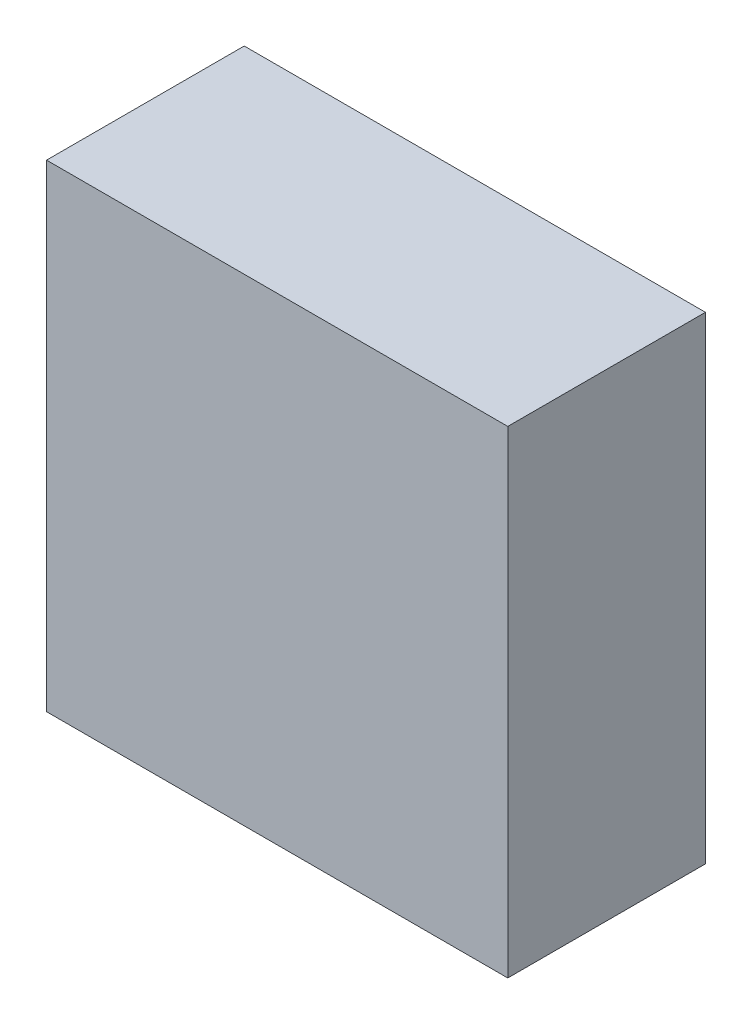
ISO-10303-21;
HEADER;
FILE_DESCRIPTION(('STEP AP214'),'2;1');
FILE_NAME('part.step','',(''),(''),'','','');
FILE_SCHEMA(('AUTOMOTIVE_DESIGN { 1 0 10303 214 1 1 1 1 }'));
ENDSEC;
DATA;
#1=APPLICATION_CONTEXT('core data for automotive mechanical design processes');
#2=APPLICATION_PROTOCOL_DEFINITION('international standard','automotive_design',2000,#1);
#3=PRODUCT_CONTEXT('',#1,'mechanical');
#4=PRODUCT('Part','Part','',(#3));
#5=PRODUCT_RELATED_PRODUCT_CATEGORY('part','',(#4));
#6=PRODUCT_DEFINITION_FORMATION('','',#4);
#7=PRODUCT_DEFINITION_CONTEXT('part definition',#1,'design');
#8=PRODUCT_DEFINITION('design','',#6,#7);
#9=PRODUCT_DEFINITION_SHAPE('','',#8);
#10=(LENGTH_UNIT() NAMED_UNIT(*) SI_UNIT(.MILLI.,.METRE.));
#11=(NAMED_UNIT(*) PLANE_ANGLE_UNIT() SI_UNIT($,.RADIAN.));
#12=(NAMED_UNIT(*) SI_UNIT($,.STERADIAN.) SOLID_ANGLE_UNIT());
#13=UNCERTAINTY_MEASURE_WITH_UNIT(LENGTH_MEASURE(1.E-05),#10,'distance_accuracy_value','');
#14=(GEOMETRIC_REPRESENTATION_CONTEXT(3) GLOBAL_UNCERTAINTY_ASSIGNED_CONTEXT((#13)) GLOBAL_UNIT_ASSIGNED_CONTEXT((#10,
#11,#12)) REPRESENTATION_CONTEXT('',''));
#15=CARTESIAN_POINT('',(0.,0.,0.));
#16=DIRECTION('',(0.,0.,1.));
#17=DIRECTION('',(1.,0.,0.));
#18=AXIS2_PLACEMENT_3D('',#15,#16,#17);
#19=CARTESIAN_POINT('',(-0.700001716857926,0.724992278693463,0.));
#20=DIRECTION('',(-1.,1.19248806385031E-08,0.));
#21=DIRECTION('',(-1.19248806385031E-08,-1.,0.));
#22=AXIS2_PLACEMENT_3D('',#19,#20,#21);
#23=PLANE('',#22);
#24=DIRECTION('',(-1.1924880607005E-08,-1.,0.));
#25=VECTOR('',#24,1.);
#26=CARTESIAN_POINT('',(-0.700001716857926,0.724992278693463,0.));
#27=LINE('',#26,#25);
#28=CARTESIAN_POINT('',(-0.700001716857926,0.724992278693463,0.));
#29=VERTEX_POINT('',#28);
#30=CARTESIAN_POINT('',(-0.700001734148969,-0.725004669548724,0.));
#31=VERTEX_POINT('',#30);
#32=EDGE_CURVE('E11',#29,#31,#27,.T.);
#33=ORIENTED_EDGE('',*,*,#32,.T.);
#34=DIRECTION('',(0.,0.,1.));
#35=VECTOR('',#34,1.);
#36=CARTESIAN_POINT('',(-0.700001734148967,-0.725004669548724,0.));
#37=LINE('',#36,#35);
#38=CARTESIAN_POINT('',(-0.700001734148969,-0.725004669548724,0.599998772144318));
#39=VERTEX_POINT('',#38);
#40=EDGE_CURVE('E88',#31,#39,#37,.T.);
#41=ORIENTED_EDGE('',*,*,#40,.T.);
#42=DIRECTION('',(-1.1924880607005E-08,-1.,0.));
#43=VECTOR('',#42,1.);
#44=CARTESIAN_POINT('',(-0.700001716857926,0.724992278693463,0.599998772144318));
#45=LINE('',#44,#43);
#46=CARTESIAN_POINT('',(-0.700001716857926,0.724992278693463,0.599998772144318));
#47=VERTEX_POINT('',#46);
#48=EDGE_CURVE('E83',#47,#39,#45,.T.);
#49=ORIENTED_EDGE('',*,*,#48,.F.);
#50=DIRECTION('',(0.,0.,1.));
#51=VECTOR('',#50,1.);
#52=CARTESIAN_POINT('',(-0.700001716857926,0.724992278693453,0.));
#53=LINE('',#52,#51);
#54=EDGE_CURVE('E72',#29,#47,#53,.T.);
#55=ORIENTED_EDGE('',*,*,#54,.F.);
#56=EDGE_LOOP('',(#33,#41,#49,#55));
#57=FACE_BOUND('',#56,.T.);
#58=ADVANCED_FACE('F17',(#57),#23,.T.);
#59=CARTESIAN_POINT('',(-0.700001734148969,-0.725004669548724,0.));
#60=DIRECTION('',(-1.19248806385031E-08,-1.,0.));
#61=DIRECTION('',(1.,-1.19248806385031E-08,0.));
#62=AXIS2_PLACEMENT_3D('',#59,#60,#61);
#63=PLANE('',#62);
#64=DIRECTION('',(1.,-1.1924880652559E-08,0.));
#65=VECTOR('',#64,1.);
#66=CARTESIAN_POINT('',(-0.700001734148969,-0.725004669548724,0.));
#67=LINE('',#66,#65);
#68=CARTESIAN_POINT('',(0.699992162335406,-0.725004686243494,0.));
#69=VERTEX_POINT('',#68);
#70=EDGE_CURVE('E24',#31,#69,#67,.T.);
#71=ORIENTED_EDGE('',*,*,#70,.T.);
#72=DIRECTION('',(0.,0.,1.));
#73=VECTOR('',#72,1.);
#74=CARTESIAN_POINT('',(0.699992162335406,-0.725004686243484,0.));
#75=LINE('',#74,#73);
#76=CARTESIAN_POINT('',(0.699992162335406,-0.725004686243494,0.599998772144318));
#77=VERTEX_POINT('',#76);
#78=EDGE_CURVE('E85',#69,#77,#75,.T.);
#79=ORIENTED_EDGE('',*,*,#78,.T.);
#80=DIRECTION('',(1.,-1.1924880652559E-08,0.));
#81=VECTOR('',#80,1.);
#82=CARTESIAN_POINT('',(-0.700001734148969,-0.725004669548724,0.599998772144318));
#83=LINE('',#82,#81);
#84=EDGE_CURVE('E66',#39,#77,#83,.T.);
#85=ORIENTED_EDGE('',*,*,#84,.F.);
#86=ORIENTED_EDGE('',*,*,#40,.F.);
#87=EDGE_LOOP('',(#71,#79,#85,#86));
#88=FACE_BOUND('',#87,.T.);
#89=ADVANCED_FACE('F89',(#88),#63,.T.);
#90=CARTESIAN_POINT('',(0.699992162335406,-0.725004686243494,0.));
#91=DIRECTION('',(1.,-1.19248806385031E-08,0.));
#92=DIRECTION('',(1.19248806385031E-08,1.,0.));
#93=AXIS2_PLACEMENT_3D('',#90,#91,#92);
#94=PLANE('',#93);
#95=DIRECTION('',(1.1924880607005E-08,1.,0.));
#96=VECTOR('',#95,1.);
#97=CARTESIAN_POINT('',(0.699992162335406,-0.725004686243494,0.));
#98=LINE('',#97,#96);
#99=CARTESIAN_POINT('',(0.699992179626449,0.724992261998693,0.));
#100=VERTEX_POINT('',#99);
#101=EDGE_CURVE('E62',#69,#100,#98,.T.);
#102=ORIENTED_EDGE('',*,*,#101,.T.);
#103=DIRECTION('',(0.,0.,1.));
#104=VECTOR('',#103,1.);
#105=CARTESIAN_POINT('',(0.699992179626446,0.724992261998693,0.));
#106=LINE('',#105,#104);
#107=CARTESIAN_POINT('',(0.699992179626449,0.724992261998693,0.599998772144318));
#108=VERTEX_POINT('',#107);
#109=EDGE_CURVE('E55',#100,#108,#106,.T.);
#110=ORIENTED_EDGE('',*,*,#109,.T.);
#111=DIRECTION('',(1.1924880607005E-08,1.,0.));
#112=VECTOR('',#111,1.);
#113=CARTESIAN_POINT('',(0.699992162335406,-0.725004686243494,0.599998772144318));
#114=LINE('',#113,#112);
#115=EDGE_CURVE('E59',#77,#108,#114,.T.);
#116=ORIENTED_EDGE('',*,*,#115,.F.);
#117=ORIENTED_EDGE('',*,*,#78,.F.);
#118=EDGE_LOOP('',(#102,#110,#116,#117));
#119=FACE_BOUND('',#118,.T.);
#120=ADVANCED_FACE('F57',(#119),#94,.T.);
#121=CARTESIAN_POINT('',(0.699992179626449,0.724992261998693,0.));
#122=DIRECTION('',(1.19248806385031E-08,1.,0.));
#123=DIRECTION('',(-1.,1.19248806385031E-08,0.));
#124=AXIS2_PLACEMENT_3D('',#121,#122,#123);
#125=PLANE('',#124);
#126=DIRECTION('',(-1.,1.1924880652559E-08,0.));
#127=VECTOR('',#126,1.);
#128=CARTESIAN_POINT('',(0.699992179626449,0.724992261998693,0.));
#129=LINE('',#128,#127);
#130=EDGE_CURVE('E65',#100,#29,#129,.T.);
#131=ORIENTED_EDGE('',*,*,#130,.T.);
#132=ORIENTED_EDGE('',*,*,#54,.T.);
#133=DIRECTION('',(-1.,1.1924880652559E-08,0.));
#134=VECTOR('',#133,1.);
#135=CARTESIAN_POINT('',(0.699992179626449,0.724992261998693,0.599998772144318));
#136=LINE('',#135,#134);
#137=EDGE_CURVE('E70',#108,#47,#136,.T.);
#138=ORIENTED_EDGE('',*,*,#137,.F.);
#139=ORIENTED_EDGE('',*,*,#109,.F.);
#140=EDGE_LOOP('',(#131,#132,#138,#139));
#141=FACE_BOUND('',#140,.T.);
#142=ADVANCED_FACE('F71',(#141),#125,.T.);
#143=CARTESIAN_POINT('',(119.549995422363,-239.175003051758,0.599998772144318));
#144=DIRECTION('',(0.,0.,1.));
#145=DIRECTION('',(1.19248806385031E-08,1.,0.));
#146=AXIS2_PLACEMENT_3D('',#143,#144,#145);
#147=PLANE('',#146);
#148=ORIENTED_EDGE('',*,*,#48,.T.);
#149=ORIENTED_EDGE('',*,*,#84,.T.);
#150=ORIENTED_EDGE('',*,*,#115,.T.);
#151=ORIENTED_EDGE('',*,*,#137,.T.);
#152=EDGE_LOOP('',(#148,#149,#150,#151));
#153=FACE_BOUND('',#152,.T.);
#154=ADVANCED_FACE('F76',(#153),#147,.T.);
#155=CARTESIAN_POINT('',(119.549995422363,-239.175003051758,0.));
#156=DIRECTION('',(0.,0.,1.));
#157=DIRECTION('',(1.19248806385031E-08,1.,0.));
#158=AXIS2_PLACEMENT_3D('',#155,#156,#157);
#159=PLANE('',#158);
#160=ORIENTED_EDGE('',*,*,#130,.F.);
#161=ORIENTED_EDGE('',*,*,#101,.F.);
#162=ORIENTED_EDGE('',*,*,#70,.F.);
#163=ORIENTED_EDGE('',*,*,#32,.F.);
#164=EDGE_LOOP('',(#160,#161,#162,#163));
#165=FACE_BOUND('',#164,.T.);
#166=ADVANCED_FACE('F91',(#165),#159,.F.);
#167=CLOSED_SHELL('',(#58,#89,#120,#142,#154,#166));
#168=MANIFOLD_SOLID_BREP('B1',#167);
#169=ADVANCED_BREP_SHAPE_REPRESENTATION('',(#18,#168),#14);
#170=SHAPE_DEFINITION_REPRESENTATION(#9,#169);
ENDSEC;
END-ISO-10303-21;
